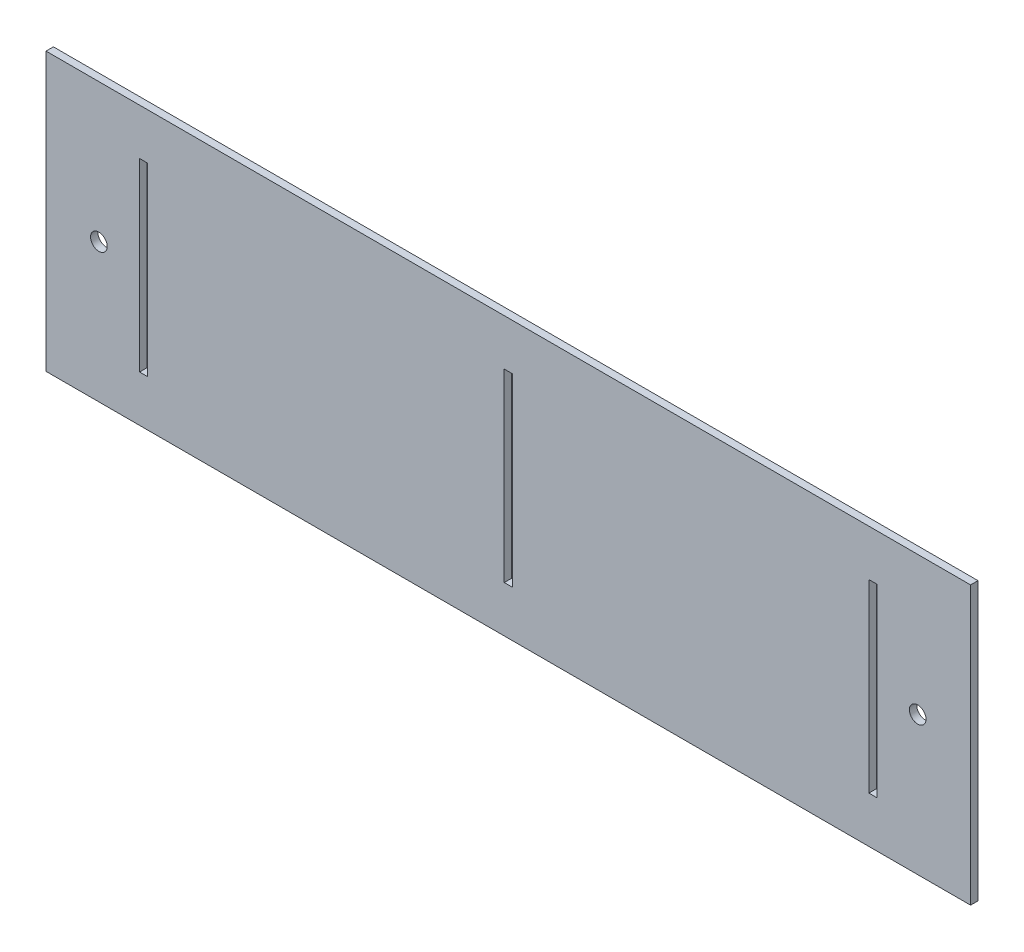
ISO-10303-21;
HEADER;
FILE_DESCRIPTION(('STEP AP214'),'2;1');
FILE_NAME('part.step','',(''),(''),'','','');
FILE_SCHEMA(('AUTOMOTIVE_DESIGN { 1 0 10303 214 1 1 1 1 }'));
ENDSEC;
DATA;
#1=APPLICATION_CONTEXT('core data for automotive mechanical design processes');
#2=APPLICATION_PROTOCOL_DEFINITION('international standard','automotive_design',2000,#1);
#3=PRODUCT_CONTEXT('',#1,'mechanical');
#4=PRODUCT('Part','Part','',(#3));
#5=PRODUCT_RELATED_PRODUCT_CATEGORY('part','',(#4));
#6=PRODUCT_DEFINITION_FORMATION('','',#4);
#7=PRODUCT_DEFINITION_CONTEXT('part definition',#1,'design');
#8=PRODUCT_DEFINITION('design','',#6,#7);
#9=PRODUCT_DEFINITION_SHAPE('','',#8);
#10=(LENGTH_UNIT() NAMED_UNIT(*) SI_UNIT(.MILLI.,.METRE.));
#11=(NAMED_UNIT(*) PLANE_ANGLE_UNIT() SI_UNIT($,.RADIAN.));
#12=(NAMED_UNIT(*) SI_UNIT($,.STERADIAN.) SOLID_ANGLE_UNIT());
#13=UNCERTAINTY_MEASURE_WITH_UNIT(LENGTH_MEASURE(1.E-05),#10,'distance_accuracy_value','');
#14=(GEOMETRIC_REPRESENTATION_CONTEXT(3) GLOBAL_UNCERTAINTY_ASSIGNED_CONTEXT((#13)) GLOBAL_UNIT_ASSIGNED_CONTEXT((#10,
#11,#12)) REPRESENTATION_CONTEXT('',''));
#15=CARTESIAN_POINT('',(0.,0.,0.));
#16=DIRECTION('',(0.,0.,1.));
#17=DIRECTION('',(1.,0.,0.));
#18=AXIS2_PLACEMENT_3D('',#15,#16,#17);
#19=CARTESIAN_POINT('',(0.,0.,2.));
#20=DIRECTION('',(0.,0.,1.));
#21=DIRECTION('',(1.,0.,0.));
#22=AXIS2_PLACEMENT_3D('',#19,#20,#21);
#23=PLANE('',#22);
#24=CARTESIAN_POINT('',(-59.381758713842,40.8846710241476,2.));
#25=DIRECTION('',(0.,0.,1.));
#26=DIRECTION('',(1.,0.,0.));
#27=AXIS2_PLACEMENT_3D('',#24,#25,#26);
#28=CIRCLE('',#27,2.25);
#29=CARTESIAN_POINT('',(-57.131758713842,40.8846710241476,2.));
#30=VERTEX_POINT('',#29);
#31=EDGE_CURVE('E323',#30,#30,#28,.T.);
#32=ORIENTED_EDGE('',*,*,#31,.F.);
#33=EDGE_LOOP('',(#32));
#34=FACE_BOUND('',#33,.T.);
#35=CARTESIAN_POINT('',(162.018241286158,40.8846710241476,2.));
#36=DIRECTION('',(0.,0.,1.));
#37=DIRECTION('',(-1.,0.,0.));
#38=AXIS2_PLACEMENT_3D('',#35,#36,#37);
#39=CIRCLE('',#38,2.24999999999998);
#40=CARTESIAN_POINT('',(159.768241286158,40.8846710241476,2.));
#41=VERTEX_POINT('',#40);
#42=EDGE_CURVE('E330',#41,#41,#39,.T.);
#43=ORIENTED_EDGE('',*,*,#42,.F.);
#44=EDGE_LOOP('',(#43));
#45=FACE_BOUND('',#44,.T.);
#46=DIRECTION('',(0.,-1.,0.));
#47=VECTOR('',#46,1.);
#48=CARTESIAN_POINT('',(-73.681758713842,78.3846710241476,2.));
#49=LINE('',#48,#47);
#50=CARTESIAN_POINT('',(-73.681758713842,78.3846710241476,2.));
#51=VERTEX_POINT('',#50);
#52=CARTESIAN_POINT('',(-73.681758713842,3.3846710241476,2.));
#53=VERTEX_POINT('',#52);
#54=EDGE_CURVE('E246',#51,#53,#49,.T.);
#55=ORIENTED_EDGE('',*,*,#54,.T.);
#56=DIRECTION('',(1.,0.,0.));
#57=VECTOR('',#56,1.);
#58=CARTESIAN_POINT('',(-73.681758713842,3.3846710241476,2.));
#59=LINE('',#58,#57);
#60=CARTESIAN_POINT('',(176.318241286158,3.3846710241476,2.));
#61=VERTEX_POINT('',#60);
#62=EDGE_CURVE('E250',#53,#61,#59,.T.);
#63=ORIENTED_EDGE('',*,*,#62,.T.);
#64=DIRECTION('',(0.,1.,0.));
#65=VECTOR('',#64,1.);
#66=CARTESIAN_POINT('',(176.318241286158,78.3846710241476,2.));
#67=LINE('',#66,#65);
#68=CARTESIAN_POINT('',(176.318241286158,78.3846710241476,2.));
#69=VERTEX_POINT('',#68);
#70=EDGE_CURVE('E254',#61,#69,#67,.T.);
#71=ORIENTED_EDGE('',*,*,#70,.T.);
#72=DIRECTION('',(-1.,0.,0.));
#73=VECTOR('',#72,1.);
#74=CARTESIAN_POINT('',(-73.681758713842,78.3846710241476,2.));
#75=LINE('',#74,#73);
#76=EDGE_CURVE('E257',#69,#51,#75,.T.);
#77=ORIENTED_EDGE('',*,*,#76,.T.);
#78=EDGE_LOOP('',(#55,#63,#71,#77));
#79=FACE_BOUND('',#78,.T.);
#80=DIRECTION('',(0.,-1.,0.));
#81=VECTOR('',#80,1.);
#82=CARTESIAN_POINT('',(148.818241286158,65.8846710241476,2.));
#83=LINE('',#82,#81);
#84=CARTESIAN_POINT('',(148.818241286158,65.8846710241476,2.));
#85=VERTEX_POINT('',#84);
#86=CARTESIAN_POINT('',(148.818241286158,15.8846710241476,2.));
#87=VERTEX_POINT('',#86);
#88=EDGE_CURVE('E222',#85,#87,#83,.T.);
#89=ORIENTED_EDGE('',*,*,#88,.F.);
#90=DIRECTION('',(-1.,0.,0.));
#91=VECTOR('',#90,1.);
#92=CARTESIAN_POINT('',(151.018241286158,65.8846710241476,2.));
#93=LINE('',#92,#91);
#94=CARTESIAN_POINT('',(151.018241286158,65.8846710241476,2.));
#95=VERTEX_POINT('',#94);
#96=EDGE_CURVE('E219',#95,#85,#93,.T.);
#97=ORIENTED_EDGE('',*,*,#96,.F.);
#98=DIRECTION('',(0.,1.,0.));
#99=VECTOR('',#98,1.);
#100=CARTESIAN_POINT('',(151.018241286158,65.8846710241476,2.));
#101=LINE('',#100,#99);
#102=CARTESIAN_POINT('',(151.018241286158,15.8846710241476,2.));
#103=VERTEX_POINT('',#102);
#104=EDGE_CURVE('E229',#103,#95,#101,.T.);
#105=ORIENTED_EDGE('',*,*,#104,.F.);
#106=DIRECTION('',(1.,0.,0.));
#107=VECTOR('',#106,1.);
#108=CARTESIAN_POINT('',(151.018241286158,15.8846710241476,2.));
#109=LINE('',#108,#107);
#110=EDGE_CURVE('E225',#87,#103,#109,.T.);
#111=ORIENTED_EDGE('',*,*,#110,.F.);
#112=EDGE_LOOP('',(#89,#97,#105,#111));
#113=FACE_BOUND('',#112,.T.);
#114=DIRECTION('',(1.,0.,0.));
#115=VECTOR('',#114,1.);
#116=CARTESIAN_POINT('',(50.218241286158,15.8846710241476,2.));
#117=LINE('',#116,#115);
#118=CARTESIAN_POINT('',(50.218241286158,15.8846710241476,2.));
#119=VERTEX_POINT('',#118);
#120=CARTESIAN_POINT('',(52.418241286158,15.8846710241476,2.));
#121=VERTEX_POINT('',#120);
#122=EDGE_CURVE('E197',#119,#121,#117,.T.);
#123=ORIENTED_EDGE('',*,*,#122,.F.);
#124=DIRECTION('',(0.,-1.,0.));
#125=VECTOR('',#124,1.);
#126=CARTESIAN_POINT('',(50.218241286158,65.8846710241476,2.));
#127=LINE('',#126,#125);
#128=CARTESIAN_POINT('',(50.218241286158,65.8846710241476,2.));
#129=VERTEX_POINT('',#128);
#130=EDGE_CURVE('E194',#129,#119,#127,.T.);
#131=ORIENTED_EDGE('',*,*,#130,.F.);
#132=DIRECTION('',(-1.,0.,0.));
#133=VECTOR('',#132,1.);
#134=CARTESIAN_POINT('',(50.218241286158,65.8846710241476,2.));
#135=LINE('',#134,#133);
#136=CARTESIAN_POINT('',(52.418241286158,65.8846710241476,2.));
#137=VERTEX_POINT('',#136);
#138=EDGE_CURVE('E204',#137,#129,#135,.T.);
#139=ORIENTED_EDGE('',*,*,#138,.F.);
#140=DIRECTION('',(0.,1.,0.));
#141=VECTOR('',#140,1.);
#142=CARTESIAN_POINT('',(52.418241286158,65.8846710241476,2.));
#143=LINE('',#142,#141);
#144=EDGE_CURVE('E201',#121,#137,#143,.T.);
#145=ORIENTED_EDGE('',*,*,#144,.F.);
#146=EDGE_LOOP('',(#123,#131,#139,#145));
#147=FACE_BOUND('',#146,.T.);
#148=DIRECTION('',(1.,0.,0.));
#149=VECTOR('',#148,1.);
#150=CARTESIAN_POINT('',(-48.381758713842,15.8846710241476,2.));
#151=LINE('',#150,#149);
#152=CARTESIAN_POINT('',(-48.381758713842,15.8846710241476,2.));
#153=VERTEX_POINT('',#152);
#154=CARTESIAN_POINT('',(-46.181758713842,15.8846710241476,2.));
#155=VERTEX_POINT('',#154);
#156=EDGE_CURVE('E165',#153,#155,#151,.T.);
#157=ORIENTED_EDGE('',*,*,#156,.F.);
#158=DIRECTION('',(0.,-1.,0.));
#159=VECTOR('',#158,1.);
#160=CARTESIAN_POINT('',(-48.381758713842,65.8846710241476,2.));
#161=LINE('',#160,#159);
#162=CARTESIAN_POINT('',(-48.381758713842,65.8846710241476,2.));
#163=VERTEX_POINT('',#162);
#164=EDGE_CURVE('E155',#163,#153,#161,.T.);
#165=ORIENTED_EDGE('',*,*,#164,.F.);
#166=DIRECTION('',(-1.,0.,0.));
#167=VECTOR('',#166,1.);
#168=CARTESIAN_POINT('',(-48.381758713842,65.8846710241476,2.));
#169=LINE('',#168,#167);
#170=CARTESIAN_POINT('',(-46.181758713842,65.8846710241476,2.));
#171=VERTEX_POINT('',#170);
#172=EDGE_CURVE('E182',#171,#163,#169,.T.);
#173=ORIENTED_EDGE('',*,*,#172,.F.);
#174=DIRECTION('',(0.,1.,0.));
#175=VECTOR('',#174,1.);
#176=CARTESIAN_POINT('',(-46.181758713842,65.8846710241476,2.));
#177=LINE('',#176,#175);
#178=EDGE_CURVE('E178',#155,#171,#177,.T.);
#179=ORIENTED_EDGE('',*,*,#178,.F.);
#180=EDGE_LOOP('',(#157,#165,#173,#179));
#181=FACE_BOUND('',#180,.T.);
#182=ADVANCED_FACE('F38',(#34,#45,#79,#113,#147,#181),#23,.T.);
#183=CARTESIAN_POINT('',(0.,0.,0.));
#184=DIRECTION('',(0.,0.,1.));
#185=DIRECTION('',(1.,0.,0.));
#186=AXIS2_PLACEMENT_3D('',#183,#184,#185);
#187=PLANE('',#186);
#188=CARTESIAN_POINT('',(-59.381758713842,40.8846710241476,0.));
#189=DIRECTION('',(0.,0.,1.));
#190=DIRECTION('',(1.,0.,0.));
#191=AXIS2_PLACEMENT_3D('',#188,#189,#190);
#192=CIRCLE('',#191,2.25);
#193=CARTESIAN_POINT('',(-57.131758713842,40.8846710241476,0.));
#194=VERTEX_POINT('',#193);
#195=EDGE_CURVE('E42',#194,#194,#192,.F.);
#196=ORIENTED_EDGE('',*,*,#195,.F.);
#197=EDGE_LOOP('',(#196));
#198=FACE_BOUND('',#197,.T.);
#199=CARTESIAN_POINT('',(162.018241286158,40.8846710241476,0.));
#200=DIRECTION('',(0.,0.,1.));
#201=DIRECTION('',(1.,0.,0.));
#202=AXIS2_PLACEMENT_3D('',#199,#200,#201);
#203=CIRCLE('',#202,2.24999999999998);
#204=CARTESIAN_POINT('',(164.268241286158,40.8846710241476,0.));
#205=VERTEX_POINT('',#204);
#206=EDGE_CURVE('E320',#205,#205,#203,.F.);
#207=ORIENTED_EDGE('',*,*,#206,.F.);
#208=EDGE_LOOP('',(#207));
#209=FACE_BOUND('',#208,.T.);
#210=DIRECTION('',(0.,1.,0.));
#211=VECTOR('',#210,1.);
#212=CARTESIAN_POINT('',(50.218241286158,0.,0.));
#213=LINE('',#212,#211);
#214=CARTESIAN_POINT('',(50.218241286158,15.8846710241476,0.));
#215=VERTEX_POINT('',#214);
#216=CARTESIAN_POINT('',(50.218241286158,65.8846710241476,0.));
#217=VERTEX_POINT('',#216);
#218=EDGE_CURVE('E309',#215,#217,#213,.T.);
#219=ORIENTED_EDGE('',*,*,#218,.F.);
#220=DIRECTION('',(-1.,0.,0.));
#221=VECTOR('',#220,1.);
#222=CARTESIAN_POINT('',(0.,15.8846710241476,0.));
#223=LINE('',#222,#221);
#224=CARTESIAN_POINT('',(52.418241286158,15.8846710241476,0.));
#225=VERTEX_POINT('',#224);
#226=EDGE_CURVE('E306',#225,#215,#223,.T.);
#227=ORIENTED_EDGE('',*,*,#226,.F.);
#228=DIRECTION('',(0.,-1.,0.));
#229=VECTOR('',#228,1.);
#230=CARTESIAN_POINT('',(52.418241286158,0.,0.));
#231=LINE('',#230,#229);
#232=CARTESIAN_POINT('',(52.418241286158,65.8846710241476,0.));
#233=VERTEX_POINT('',#232);
#234=EDGE_CURVE('E303',#233,#225,#231,.T.);
#235=ORIENTED_EDGE('',*,*,#234,.F.);
#236=DIRECTION('',(1.,0.,0.));
#237=VECTOR('',#236,1.);
#238=CARTESIAN_POINT('',(0.,65.8846710241476,0.));
#239=LINE('',#238,#237);
#240=EDGE_CURVE('E300',#217,#233,#239,.T.);
#241=ORIENTED_EDGE('',*,*,#240,.F.);
#242=EDGE_LOOP('',(#219,#227,#235,#241));
#243=FACE_BOUND('',#242,.T.);
#244=DIRECTION('',(0.,-1.,0.));
#245=VECTOR('',#244,1.);
#246=CARTESIAN_POINT('',(-73.681758713842,78.3846710241476,0.));
#247=LINE('',#246,#245);
#248=CARTESIAN_POINT('',(-73.681758713842,78.3846710241476,0.));
#249=VERTEX_POINT('',#248);
#250=CARTESIAN_POINT('',(-73.681758713842,3.3846710241476,0.));
#251=VERTEX_POINT('',#250);
#252=EDGE_CURVE('E174',#249,#251,#247,.T.);
#253=ORIENTED_EDGE('',*,*,#252,.F.);
#254=DIRECTION('',(-1.,0.,0.));
#255=VECTOR('',#254,1.);
#256=CARTESIAN_POINT('',(-73.681758713842,78.3846710241476,0.));
#257=LINE('',#256,#255);
#258=CARTESIAN_POINT('',(176.318241286158,78.3846710241476,0.));
#259=VERTEX_POINT('',#258);
#260=EDGE_CURVE('E251',#259,#249,#257,.T.);
#261=ORIENTED_EDGE('',*,*,#260,.F.);
#262=DIRECTION('',(0.,1.,0.));
#263=VECTOR('',#262,1.);
#264=CARTESIAN_POINT('',(176.318241286158,78.3846710241476,0.));
#265=LINE('',#264,#263);
#266=CARTESIAN_POINT('',(176.318241286158,3.3846710241476,0.));
#267=VERTEX_POINT('',#266);
#268=EDGE_CURVE('E267',#267,#259,#265,.T.);
#269=ORIENTED_EDGE('',*,*,#268,.F.);
#270=DIRECTION('',(1.,0.,0.));
#271=VECTOR('',#270,1.);
#272=CARTESIAN_POINT('',(-73.681758713842,3.3846710241476,0.));
#273=LINE('',#272,#271);
#274=EDGE_CURVE('E264',#251,#267,#273,.T.);
#275=ORIENTED_EDGE('',*,*,#274,.F.);
#276=EDGE_LOOP('',(#253,#261,#269,#275));
#277=FACE_BOUND('',#276,.T.);
#278=DIRECTION('',(1.,0.,0.));
#279=VECTOR('',#278,1.);
#280=CARTESIAN_POINT('',(0.,65.8846710241476,0.));
#281=LINE('',#280,#279);
#282=CARTESIAN_POINT('',(148.818241286158,65.8846710241476,0.));
#283=VERTEX_POINT('',#282);
#284=CARTESIAN_POINT('',(151.018241286158,65.8846710241476,0.));
#285=VERTEX_POINT('',#284);
#286=EDGE_CURVE('E296',#283,#285,#281,.T.);
#287=ORIENTED_EDGE('',*,*,#286,.F.);
#288=DIRECTION('',(0.,1.,0.));
#289=VECTOR('',#288,1.);
#290=CARTESIAN_POINT('',(148.818241286158,0.,0.));
#291=LINE('',#290,#289);
#292=CARTESIAN_POINT('',(148.818241286158,15.8846710241476,0.));
#293=VERTEX_POINT('',#292);
#294=EDGE_CURVE('E293',#293,#283,#291,.T.);
#295=ORIENTED_EDGE('',*,*,#294,.F.);
#296=DIRECTION('',(-1.,0.,0.));
#297=VECTOR('',#296,1.);
#298=CARTESIAN_POINT('',(0.,15.8846710241476,0.));
#299=LINE('',#298,#297);
#300=CARTESIAN_POINT('',(151.018241286158,15.8846710241476,0.));
#301=VERTEX_POINT('',#300);
#302=EDGE_CURVE('E290',#301,#293,#299,.T.);
#303=ORIENTED_EDGE('',*,*,#302,.F.);
#304=DIRECTION('',(0.,-1.,0.));
#305=VECTOR('',#304,1.);
#306=CARTESIAN_POINT('',(151.018241286158,0.,0.));
#307=LINE('',#306,#305);
#308=EDGE_CURVE('E287',#285,#301,#307,.T.);
#309=ORIENTED_EDGE('',*,*,#308,.F.);
#310=EDGE_LOOP('',(#287,#295,#303,#309));
#311=FACE_BOUND('',#310,.T.);
#312=DIRECTION('',(0.,1.,0.));
#313=VECTOR('',#312,1.);
#314=CARTESIAN_POINT('',(-48.381758713842,0.,0.));
#315=LINE('',#314,#313);
#316=CARTESIAN_POINT('',(-48.381758713842,15.8846710241476,0.));
#317=VERTEX_POINT('',#316);
#318=CARTESIAN_POINT('',(-48.381758713842,65.8846710241476,0.));
#319=VERTEX_POINT('',#318);
#320=EDGE_CURVE('E11',#317,#319,#315,.T.);
#321=ORIENTED_EDGE('',*,*,#320,.F.);
#322=DIRECTION('',(-1.,0.,0.));
#323=VECTOR('',#322,1.);
#324=CARTESIAN_POINT('',(0.,15.8846710241477,0.));
#325=LINE('',#324,#323);
#326=CARTESIAN_POINT('',(-46.181758713842,15.8846710241476,0.));
#327=VERTEX_POINT('',#326);
#328=EDGE_CURVE('E48',#327,#317,#325,.T.);
#329=ORIENTED_EDGE('',*,*,#328,.F.);
#330=DIRECTION('',(0.,-1.,0.));
#331=VECTOR('',#330,1.);
#332=CARTESIAN_POINT('',(-46.181758713842,0.,0.));
#333=LINE('',#332,#331);
#334=CARTESIAN_POINT('',(-46.181758713842,65.8846710241476,0.));
#335=VERTEX_POINT('',#334);
#336=EDGE_CURVE('E316',#335,#327,#333,.T.);
#337=ORIENTED_EDGE('',*,*,#336,.F.);
#338=DIRECTION('',(1.,0.,0.));
#339=VECTOR('',#338,1.);
#340=CARTESIAN_POINT('',(0.,65.8846710241476,0.));
#341=LINE('',#340,#339);
#342=EDGE_CURVE('E313',#319,#335,#341,.T.);
#343=ORIENTED_EDGE('',*,*,#342,.F.);
#344=EDGE_LOOP('',(#321,#329,#337,#343));
#345=FACE_BOUND('',#344,.T.);
#346=ADVANCED_FACE('F342',(#198,#209,#243,#277,#311,#345),#187,.F.);
#347=CARTESIAN_POINT('',(-73.681758713842,78.3846710241476,2.));
#348=DIRECTION('',(1.,0.,0.));
#349=DIRECTION('',(0.,0.,-1.));
#350=AXIS2_PLACEMENT_3D('',#347,#348,#349);
#351=PLANE('',#350);
#352=ORIENTED_EDGE('',*,*,#252,.T.);
#353=DIRECTION('',(0.,0.,-1.));
#354=VECTOR('',#353,1.);
#355=CARTESIAN_POINT('',(-73.681758713842,3.3846710241476,2.));
#356=LINE('',#355,#354);
#357=EDGE_CURVE('E283',#53,#251,#356,.T.);
#358=ORIENTED_EDGE('',*,*,#357,.F.);
#359=ORIENTED_EDGE('',*,*,#54,.F.);
#360=DIRECTION('',(0.,0.,-1.));
#361=VECTOR('',#360,1.);
#362=CARTESIAN_POINT('',(-73.681758713842,78.3846710241476,2.));
#363=LINE('',#362,#361);
#364=EDGE_CURVE('E260',#51,#249,#363,.T.);
#365=ORIENTED_EDGE('',*,*,#364,.T.);
#366=EDGE_LOOP('',(#352,#358,#359,#365));
#367=FACE_BOUND('',#366,.T.);
#368=ADVANCED_FACE('F40',(#367),#351,.F.);
#369=CARTESIAN_POINT('',(-73.681758713842,3.3846710241476,2.));
#370=DIRECTION('',(0.,1.,0.));
#371=DIRECTION('',(0.,0.,1.));
#372=AXIS2_PLACEMENT_3D('',#369,#370,#371);
#373=PLANE('',#372);
#374=ORIENTED_EDGE('',*,*,#274,.T.);
#375=DIRECTION('',(0.,0.,-1.));
#376=VECTOR('',#375,1.);
#377=CARTESIAN_POINT('',(176.318241286158,3.3846710241476,2.));
#378=LINE('',#377,#376);
#379=EDGE_CURVE('E279',#61,#267,#378,.T.);
#380=ORIENTED_EDGE('',*,*,#379,.F.);
#381=ORIENTED_EDGE('',*,*,#62,.F.);
#382=ORIENTED_EDGE('',*,*,#357,.T.);
#383=EDGE_LOOP('',(#374,#380,#381,#382));
#384=FACE_BOUND('',#383,.T.);
#385=ADVANCED_FACE('F411',(#384),#373,.F.);
#386=CARTESIAN_POINT('',(176.318241286158,78.3846710241476,2.));
#387=DIRECTION('',(-1.,0.,0.));
#388=DIRECTION('',(0.,0.,1.));
#389=AXIS2_PLACEMENT_3D('',#386,#387,#388);
#390=PLANE('',#389);
#391=ORIENTED_EDGE('',*,*,#268,.T.);
#392=DIRECTION('',(0.,0.,-1.));
#393=VECTOR('',#392,1.);
#394=CARTESIAN_POINT('',(176.318241286158,78.3846710241476,2.));
#395=LINE('',#394,#393);
#396=EDGE_CURVE('E275',#69,#259,#395,.T.);
#397=ORIENTED_EDGE('',*,*,#396,.F.);
#398=ORIENTED_EDGE('',*,*,#70,.F.);
#399=ORIENTED_EDGE('',*,*,#379,.T.);
#400=EDGE_LOOP('',(#391,#397,#398,#399));
#401=FACE_BOUND('',#400,.T.);
#402=ADVANCED_FACE('F408',(#401),#390,.F.);
#403=CARTESIAN_POINT('',(-73.681758713842,78.3846710241476,2.));
#404=DIRECTION('',(0.,-1.,0.));
#405=DIRECTION('',(0.,0.,-1.));
#406=AXIS2_PLACEMENT_3D('',#403,#404,#405);
#407=PLANE('',#406);
#408=ORIENTED_EDGE('',*,*,#260,.T.);
#409=ORIENTED_EDGE('',*,*,#364,.F.);
#410=ORIENTED_EDGE('',*,*,#76,.F.);
#411=ORIENTED_EDGE('',*,*,#396,.T.);
#412=EDGE_LOOP('',(#408,#409,#410,#411));
#413=FACE_BOUND('',#412,.T.);
#414=ADVANCED_FACE('F400',(#413),#407,.F.);
#415=CARTESIAN_POINT('',(151.018241286158,65.8846710241476,2.));
#416=DIRECTION('',(0.,-1.,0.));
#417=DIRECTION('',(0.,0.,-1.));
#418=AXIS2_PLACEMENT_3D('',#415,#416,#417);
#419=PLANE('',#418);
#420=ORIENTED_EDGE('',*,*,#286,.T.);
#421=DIRECTION('',(0.,0.,-1.));
#422=VECTOR('',#421,1.);
#423=CARTESIAN_POINT('',(151.018241286158,65.8846710241476,2.));
#424=LINE('',#423,#422);
#425=EDGE_CURVE('E232',#95,#285,#424,.T.);
#426=ORIENTED_EDGE('',*,*,#425,.F.);
#427=ORIENTED_EDGE('',*,*,#96,.T.);
#428=DIRECTION('',(0.,0.,-1.));
#429=VECTOR('',#428,1.);
#430=CARTESIAN_POINT('',(148.818241286158,65.8846710241476,2.));
#431=LINE('',#430,#429);
#432=EDGE_CURVE('E198',#85,#283,#431,.T.);
#433=ORIENTED_EDGE('',*,*,#432,.T.);
#434=EDGE_LOOP('',(#420,#426,#427,#433));
#435=FACE_BOUND('',#434,.T.);
#436=ADVANCED_FACE('F397',(#435),#419,.T.);
#437=CARTESIAN_POINT('',(148.818241286158,65.8846710241476,2.));
#438=DIRECTION('',(1.,0.,0.));
#439=DIRECTION('',(0.,0.,-1.));
#440=AXIS2_PLACEMENT_3D('',#437,#438,#439);
#441=PLANE('',#440);
#442=ORIENTED_EDGE('',*,*,#294,.T.);
#443=ORIENTED_EDGE('',*,*,#432,.F.);
#444=ORIENTED_EDGE('',*,*,#88,.T.);
#445=DIRECTION('',(0.,0.,-1.));
#446=VECTOR('',#445,1.);
#447=CARTESIAN_POINT('',(148.818241286158,15.8846710241476,2.));
#448=LINE('',#447,#446);
#449=EDGE_CURVE('E239',#87,#293,#448,.T.);
#450=ORIENTED_EDGE('',*,*,#449,.T.);
#451=EDGE_LOOP('',(#442,#443,#444,#450));
#452=FACE_BOUND('',#451,.T.);
#453=ADVANCED_FACE('F393',(#452),#441,.T.);
#454=CARTESIAN_POINT('',(151.018241286158,15.8846710241476,2.));
#455=DIRECTION('',(0.,1.,0.));
#456=DIRECTION('',(0.,0.,1.));
#457=AXIS2_PLACEMENT_3D('',#454,#455,#456);
#458=PLANE('',#457);
#459=ORIENTED_EDGE('',*,*,#302,.T.);
#460=ORIENTED_EDGE('',*,*,#449,.F.);
#461=ORIENTED_EDGE('',*,*,#110,.T.);
#462=DIRECTION('',(0.,0.,-1.));
#463=VECTOR('',#462,1.);
#464=CARTESIAN_POINT('',(151.018241286158,15.8846710241476,2.));
#465=LINE('',#464,#463);
#466=EDGE_CURVE('E235',#103,#301,#465,.T.);
#467=ORIENTED_EDGE('',*,*,#466,.T.);
#468=EDGE_LOOP('',(#459,#460,#461,#467));
#469=FACE_BOUND('',#468,.T.);
#470=ADVANCED_FACE('F389',(#469),#458,.T.);
#471=CARTESIAN_POINT('',(151.018241286158,65.8846710241476,2.));
#472=DIRECTION('',(-1.,0.,0.));
#473=DIRECTION('',(0.,-1.,0.));
#474=AXIS2_PLACEMENT_3D('',#471,#472,#473);
#475=PLANE('',#474);
#476=ORIENTED_EDGE('',*,*,#308,.T.);
#477=ORIENTED_EDGE('',*,*,#466,.F.);
#478=ORIENTED_EDGE('',*,*,#104,.T.);
#479=ORIENTED_EDGE('',*,*,#425,.T.);
#480=EDGE_LOOP('',(#476,#477,#478,#479));
#481=FACE_BOUND('',#480,.T.);
#482=ADVANCED_FACE('F386',(#481),#475,.T.);
#483=CARTESIAN_POINT('',(50.218241286158,65.8846710241476,2.));
#484=DIRECTION('',(1.,0.,0.));
#485=DIRECTION('',(0.,0.,-1.));
#486=AXIS2_PLACEMENT_3D('',#483,#484,#485);
#487=PLANE('',#486);
#488=ORIENTED_EDGE('',*,*,#218,.T.);
#489=DIRECTION('',(0.,0.,-1.));
#490=VECTOR('',#489,1.);
#491=CARTESIAN_POINT('',(50.218241286158,65.8846710241476,2.));
#492=LINE('',#491,#490);
#493=EDGE_CURVE('E207',#129,#217,#492,.T.);
#494=ORIENTED_EDGE('',*,*,#493,.F.);
#495=ORIENTED_EDGE('',*,*,#130,.T.);
#496=DIRECTION('',(0.,0.,-1.));
#497=VECTOR('',#496,1.);
#498=CARTESIAN_POINT('',(50.218241286158,15.8846710241476,2.));
#499=LINE('',#498,#497);
#500=EDGE_CURVE('E166',#119,#215,#499,.T.);
#501=ORIENTED_EDGE('',*,*,#500,.T.);
#502=EDGE_LOOP('',(#488,#494,#495,#501));
#503=FACE_BOUND('',#502,.T.);
#504=ADVANCED_FACE('F369',(#503),#487,.T.);
#505=CARTESIAN_POINT('',(50.218241286158,15.8846710241476,2.));
#506=DIRECTION('',(0.,1.,0.));
#507=DIRECTION('',(0.,0.,1.));
#508=AXIS2_PLACEMENT_3D('',#505,#506,#507);
#509=PLANE('',#508);
#510=ORIENTED_EDGE('',*,*,#226,.T.);
#511=ORIENTED_EDGE('',*,*,#500,.F.);
#512=ORIENTED_EDGE('',*,*,#122,.T.);
#513=DIRECTION('',(0.,0.,-1.));
#514=VECTOR('',#513,1.);
#515=CARTESIAN_POINT('',(52.418241286158,15.8846710241476,2.));
#516=LINE('',#515,#514);
#517=EDGE_CURVE('E212',#121,#225,#516,.T.);
#518=ORIENTED_EDGE('',*,*,#517,.T.);
#519=EDGE_LOOP('',(#510,#511,#512,#518));
#520=FACE_BOUND('',#519,.T.);
#521=ADVANCED_FACE('F359',(#520),#509,.T.);
#522=CARTESIAN_POINT('',(52.418241286158,65.8846710241476,2.));
#523=DIRECTION('',(-1.,0.,0.));
#524=DIRECTION('',(0.,0.,1.));
#525=AXIS2_PLACEMENT_3D('',#522,#523,#524);
#526=PLANE('',#525);
#527=ORIENTED_EDGE('',*,*,#234,.T.);
#528=ORIENTED_EDGE('',*,*,#517,.F.);
#529=ORIENTED_EDGE('',*,*,#144,.T.);
#530=DIRECTION('',(0.,0.,-1.));
#531=VECTOR('',#530,1.);
#532=CARTESIAN_POINT('',(52.418241286158,65.8846710241476,2.));
#533=LINE('',#532,#531);
#534=EDGE_CURVE('E64',#137,#233,#533,.T.);
#535=ORIENTED_EDGE('',*,*,#534,.T.);
#536=EDGE_LOOP('',(#527,#528,#529,#535));
#537=FACE_BOUND('',#536,.T.);
#538=ADVANCED_FACE('F362',(#537),#526,.T.);
#539=CARTESIAN_POINT('',(50.218241286158,65.8846710241476,2.));
#540=DIRECTION('',(0.,-1.,0.));
#541=DIRECTION('',(0.,0.,-1.));
#542=AXIS2_PLACEMENT_3D('',#539,#540,#541);
#543=PLANE('',#542);
#544=ORIENTED_EDGE('',*,*,#240,.T.);
#545=ORIENTED_EDGE('',*,*,#534,.F.);
#546=ORIENTED_EDGE('',*,*,#138,.T.);
#547=ORIENTED_EDGE('',*,*,#493,.T.);
#548=EDGE_LOOP('',(#544,#545,#546,#547));
#549=FACE_BOUND('',#548,.T.);
#550=ADVANCED_FACE('F371',(#549),#543,.T.);
#551=CARTESIAN_POINT('',(-48.381758713842,65.8846710241476,2.));
#552=DIRECTION('',(1.,0.,0.));
#553=DIRECTION('',(0.,0.,-1.));
#554=AXIS2_PLACEMENT_3D('',#551,#552,#553);
#555=PLANE('',#554);
#556=ORIENTED_EDGE('',*,*,#320,.T.);
#557=DIRECTION('',(0.,0.,-1.));
#558=VECTOR('',#557,1.);
#559=CARTESIAN_POINT('',(-48.381758713842,65.8846710241476,2.));
#560=LINE('',#559,#558);
#561=EDGE_CURVE('E160',#163,#319,#560,.T.);
#562=ORIENTED_EDGE('',*,*,#561,.F.);
#563=ORIENTED_EDGE('',*,*,#164,.T.);
#564=DIRECTION('',(0.,0.,-1.));
#565=VECTOR('',#564,1.);
#566=CARTESIAN_POINT('',(-48.381758713842,15.8846710241476,2.));
#567=LINE('',#566,#565);
#568=EDGE_CURVE('E158',#153,#317,#567,.T.);
#569=ORIENTED_EDGE('',*,*,#568,.T.);
#570=EDGE_LOOP('',(#556,#562,#563,#569));
#571=FACE_BOUND('',#570,.T.);
#572=ADVANCED_FACE('F157',(#571),#555,.T.);
#573=CARTESIAN_POINT('',(-48.381758713842,15.8846710241476,2.));
#574=DIRECTION('',(0.,1.,0.));
#575=DIRECTION('',(-1.,0.,0.));
#576=AXIS2_PLACEMENT_3D('',#573,#574,#575);
#577=PLANE('',#576);
#578=ORIENTED_EDGE('',*,*,#328,.T.);
#579=ORIENTED_EDGE('',*,*,#568,.F.);
#580=ORIENTED_EDGE('',*,*,#156,.T.);
#581=DIRECTION('',(0.,0.,-1.));
#582=VECTOR('',#581,1.);
#583=CARTESIAN_POINT('',(-46.181758713842,15.8846710241476,2.));
#584=LINE('',#583,#582);
#585=EDGE_CURVE('E175',#155,#327,#584,.T.);
#586=ORIENTED_EDGE('',*,*,#585,.T.);
#587=EDGE_LOOP('',(#578,#579,#580,#586));
#588=FACE_BOUND('',#587,.T.);
#589=ADVANCED_FACE('F169',(#588),#577,.T.);
#590=CARTESIAN_POINT('',(-46.181758713842,65.8846710241476,2.));
#591=DIRECTION('',(-1.,0.,0.));
#592=DIRECTION('',(0.,0.,1.));
#593=AXIS2_PLACEMENT_3D('',#590,#591,#592);
#594=PLANE('',#593);
#595=ORIENTED_EDGE('',*,*,#336,.T.);
#596=ORIENTED_EDGE('',*,*,#585,.F.);
#597=ORIENTED_EDGE('',*,*,#178,.T.);
#598=DIRECTION('',(0.,0.,-1.));
#599=VECTOR('',#598,1.);
#600=CARTESIAN_POINT('',(-46.181758713842,65.8846710241476,2.));
#601=LINE('',#600,#599);
#602=EDGE_CURVE('E56',#171,#335,#601,.T.);
#603=ORIENTED_EDGE('',*,*,#602,.T.);
#604=EDGE_LOOP('',(#595,#596,#597,#603));
#605=FACE_BOUND('',#604,.T.);
#606=ADVANCED_FACE('F436',(#605),#594,.T.);
#607=CARTESIAN_POINT('',(-48.381758713842,65.8846710241476,2.));
#608=DIRECTION('',(0.,-1.,0.));
#609=DIRECTION('',(0.,0.,-1.));
#610=AXIS2_PLACEMENT_3D('',#607,#608,#609);
#611=PLANE('',#610);
#612=ORIENTED_EDGE('',*,*,#342,.T.);
#613=ORIENTED_EDGE('',*,*,#602,.F.);
#614=ORIENTED_EDGE('',*,*,#172,.T.);
#615=ORIENTED_EDGE('',*,*,#561,.T.);
#616=EDGE_LOOP('',(#612,#613,#614,#615));
#617=FACE_BOUND('',#616,.T.);
#618=ADVANCED_FACE('F434',(#617),#611,.T.);
#619=CARTESIAN_POINT('',(162.018241286158,40.8846710241476,2.));
#620=DIRECTION('',(0.,0.,-1.));
#621=DIRECTION('',(-1.,0.,0.));
#622=AXIS2_PLACEMENT_3D('',#619,#620,#621);
#623=CYLINDRICAL_SURFACE('',#622,2.24999999999998);
#624=ORIENTED_EDGE('',*,*,#42,.T.);
#625=EDGE_LOOP('',(#624));
#626=FACE_BOUND('',#625,.T.);
#627=ORIENTED_EDGE('',*,*,#206,.T.);
#628=EDGE_LOOP('',(#627));
#629=FACE_BOUND('',#628,.T.);
#630=ADVANCED_FACE('F338',(#626,#629),#623,.F.);
#631=CARTESIAN_POINT('',(-59.381758713842,40.8846710241476,2.));
#632=DIRECTION('',(0.,0.,-1.));
#633=DIRECTION('',(-1.,0.,0.));
#634=AXIS2_PLACEMENT_3D('',#631,#632,#633);
#635=CYLINDRICAL_SURFACE('',#634,2.25);
#636=ORIENTED_EDGE('',*,*,#31,.T.);
#637=EDGE_LOOP('',(#636));
#638=FACE_BOUND('',#637,.T.);
#639=ORIENTED_EDGE('',*,*,#195,.T.);
#640=EDGE_LOOP('',(#639));
#641=FACE_BOUND('',#640,.T.);
#642=ADVANCED_FACE('F447',(#638,#641),#635,.F.);
#643=CLOSED_SHELL('',(#182,#346,#368,#385,#402,#414,#436,#453,#470,#482,#504,#521,#538,#550,
#572,#589,#606,#618,#630,#642));
#644=MANIFOLD_SOLID_BREP('B2',#643);
#645=ADVANCED_BREP_SHAPE_REPRESENTATION('',(#18,#644),#14);
#646=SHAPE_DEFINITION_REPRESENTATION(#9,#645);
ENDSEC;
END-ISO-10303-21;
